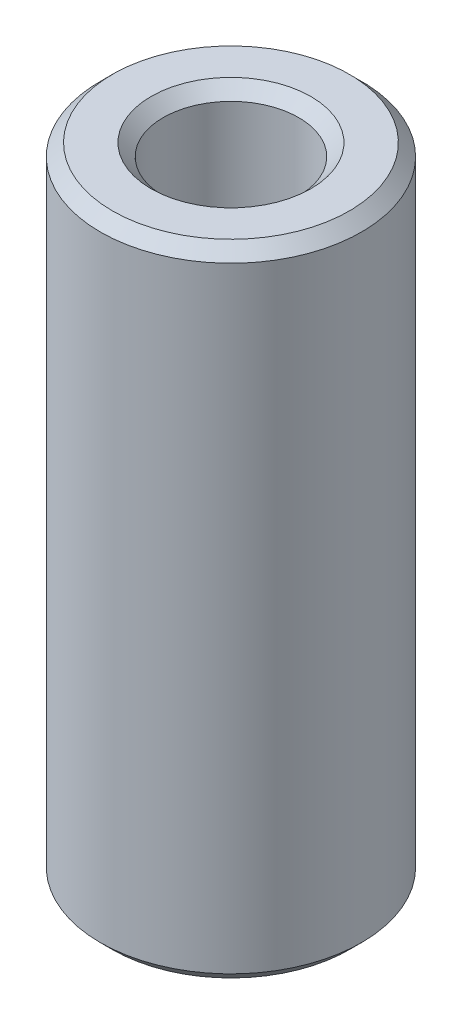
ISO-10303-21;
HEADER;
FILE_DESCRIPTION(('STEP AP214'),'2;1');
FILE_NAME('part.step','',(''),(''),'','','');
FILE_SCHEMA(('AUTOMOTIVE_DESIGN { 1 0 10303 214 1 1 1 1 }'));
ENDSEC;
DATA;
#1=APPLICATION_CONTEXT('core data for automotive mechanical design processes');
#2=APPLICATION_PROTOCOL_DEFINITION('international standard','automotive_design',2000,#1);
#3=PRODUCT_CONTEXT('',#1,'mechanical');
#4=PRODUCT('Part','Part','',(#3));
#5=PRODUCT_RELATED_PRODUCT_CATEGORY('part','',(#4));
#6=PRODUCT_DEFINITION_FORMATION('','',#4);
#7=PRODUCT_DEFINITION_CONTEXT('part definition',#1,'design');
#8=PRODUCT_DEFINITION('design','',#6,#7);
#9=PRODUCT_DEFINITION_SHAPE('','',#8);
#10=(LENGTH_UNIT() NAMED_UNIT(*) SI_UNIT(.MILLI.,.METRE.));
#11=(NAMED_UNIT(*) PLANE_ANGLE_UNIT() SI_UNIT($,.RADIAN.));
#12=(NAMED_UNIT(*) SI_UNIT($,.STERADIAN.) SOLID_ANGLE_UNIT());
#13=UNCERTAINTY_MEASURE_WITH_UNIT(LENGTH_MEASURE(1.E-05),#10,'distance_accuracy_value','');
#14=(GEOMETRIC_REPRESENTATION_CONTEXT(3) GLOBAL_UNCERTAINTY_ASSIGNED_CONTEXT((#13)) GLOBAL_UNIT_ASSIGNED_CONTEXT((#10,
#11,#12)) REPRESENTATION_CONTEXT('',''));
#15=CARTESIAN_POINT('',(0.,0.,0.));
#16=DIRECTION('',(0.,0.,1.));
#17=DIRECTION('',(1.,0.,0.));
#18=AXIS2_PLACEMENT_3D('',#15,#16,#17);
#19=CARTESIAN_POINT('',(0.,146.986770155296,0.));
#20=DIRECTION('',(0.,-1.,0.));
#21=DIRECTION('',(0.,0.,-1.));
#22=AXIS2_PLACEMENT_3D('',#19,#20,#21);
#23=CYLINDRICAL_SURFACE('',#22,30.);
#24=CARTESIAN_POINT('',(0.,2.79521145977338,0.));
#25=DIRECTION('',(0.,1.,0.));
#26=DIRECTION('',(0.,0.,1.));
#27=AXIS2_PLACEMENT_3D('',#24,#25,#26);
#28=CIRCLE('',#27,30.);
#29=CARTESIAN_POINT('',(0.,2.79521145977338,30.));
#30=VERTEX_POINT('',#29);
#31=EDGE_CURVE('E10',#30,#30,#28,.T.);
#32=ORIENTED_EDGE('',*,*,#31,.T.);
#33=EDGE_LOOP('',(#32));
#34=FACE_BOUND('',#33,.T.);
#35=CARTESIAN_POINT('',(0.,144.191558695522,0.));
#36=DIRECTION('',(0.,1.,0.));
#37=DIRECTION('',(0.,0.,1.));
#38=AXIS2_PLACEMENT_3D('',#35,#36,#37);
#39=CIRCLE('',#38,30.);
#40=CARTESIAN_POINT('',(0.,144.191558695522,30.));
#41=VERTEX_POINT('',#40);
#42=EDGE_CURVE('E50',#41,#41,#39,.F.);
#43=ORIENTED_EDGE('',*,*,#42,.T.);
#44=EDGE_LOOP('',(#43));
#45=FACE_BOUND('',#44,.T.);
#46=ADVANCED_FACE('F39',(#34,#45),#23,.T.);
#47=CARTESIAN_POINT('',(0.,146.986770155296,0.));
#48=DIRECTION('',(0.,1.,0.));
#49=DIRECTION('',(0.,0.,1.));
#50=AXIS2_PLACEMENT_3D('',#47,#48,#49);
#51=PLANE('',#50);
#52=CARTESIAN_POINT('',(0.,146.986770155296,0.));
#53=DIRECTION('',(0.,1.,0.));
#54=DIRECTION('',(0.,0.,1.));
#55=AXIS2_PLACEMENT_3D('',#52,#53,#54);
#56=CIRCLE('',#55,18.363881996797);
#57=CARTESIAN_POINT('',(0.,146.986770155296,18.363881996797));
#58=VERTEX_POINT('',#57);
#59=EDGE_CURVE('E58',#58,#58,#56,.F.);
#60=ORIENTED_EDGE('',*,*,#59,.T.);
#61=EDGE_LOOP('',(#60));
#62=FACE_BOUND('',#61,.T.);
#63=CARTESIAN_POINT('',(0.,146.986770155296,0.));
#64=DIRECTION('',(0.,1.,0.));
#65=DIRECTION('',(0.,0.,1.));
#66=AXIS2_PLACEMENT_3D('',#63,#64,#65);
#67=CIRCLE('',#66,27.2047885402266);
#68=CARTESIAN_POINT('',(0.,146.986770155296,27.2047885402266));
#69=VERTEX_POINT('',#68);
#70=EDGE_CURVE('E61',#69,#69,#67,.T.);
#71=ORIENTED_EDGE('',*,*,#70,.T.);
#72=EDGE_LOOP('',(#71));
#73=FACE_BOUND('',#72,.T.);
#74=ADVANCED_FACE('F88',(#62,#73),#51,.T.);
#75=CARTESIAN_POINT('',(0.,0.,0.));
#76=DIRECTION('',(0.,1.,0.));
#77=DIRECTION('',(0.,0.,1.));
#78=AXIS2_PLACEMENT_3D('',#75,#76,#77);
#79=PLANE('',#78);
#80=CARTESIAN_POINT('',(0.,0.,0.));
#81=DIRECTION('',(0.,1.,0.));
#82=DIRECTION('',(0.,0.,1.));
#83=AXIS2_PLACEMENT_3D('',#80,#81,#82);
#84=CIRCLE('',#83,18.363881996797);
#85=CARTESIAN_POINT('',(0.,0.,18.363881996797));
#86=VERTEX_POINT('',#85);
#87=EDGE_CURVE('E51',#86,#86,#84,.T.);
#88=ORIENTED_EDGE('',*,*,#87,.T.);
#89=EDGE_LOOP('',(#88));
#90=FACE_BOUND('',#89,.T.);
#91=CARTESIAN_POINT('',(0.,0.,0.));
#92=DIRECTION('',(0.,1.,0.));
#93=DIRECTION('',(0.,0.,1.));
#94=AXIS2_PLACEMENT_3D('',#91,#92,#93);
#95=CIRCLE('',#94,27.2047885402266);
#96=CARTESIAN_POINT('',(0.,0.,27.2047885402266));
#97=VERTEX_POINT('',#96);
#98=EDGE_CURVE('E54',#97,#97,#95,.F.);
#99=ORIENTED_EDGE('',*,*,#98,.T.);
#100=EDGE_LOOP('',(#99));
#101=FACE_BOUND('',#100,.T.);
#102=ADVANCED_FACE('F83',(#90,#101),#79,.F.);
#103=CARTESIAN_POINT('',(0.,146.986770155296,0.));
#104=DIRECTION('',(0.,-1.,0.));
#105=DIRECTION('',(0.,0.,-1.));
#106=AXIS2_PLACEMENT_3D('',#103,#104,#105);
#107=CYLINDRICAL_SURFACE('',#106,15.5686705370235);
#108=CARTESIAN_POINT('',(0.,144.191558695522,0.));
#109=DIRECTION('',(0.,1.,0.));
#110=DIRECTION('',(0.,0.,1.));
#111=AXIS2_PLACEMENT_3D('',#108,#109,#110);
#112=CIRCLE('',#111,15.5686705370235);
#113=CARTESIAN_POINT('',(0.,144.191558695522,15.5686705370235));
#114=VERTEX_POINT('',#113);
#115=EDGE_CURVE('E67',#114,#114,#112,.T.);
#116=ORIENTED_EDGE('',*,*,#115,.T.);
#117=EDGE_LOOP('',(#116));
#118=FACE_BOUND('',#117,.T.);
#119=CARTESIAN_POINT('',(0.,2.79521145977346,0.));
#120=DIRECTION('',(0.,1.,0.));
#121=DIRECTION('',(0.,0.,1.));
#122=AXIS2_PLACEMENT_3D('',#119,#120,#121);
#123=CIRCLE('',#122,15.5686705370235);
#124=CARTESIAN_POINT('',(0.,2.79521145977346,15.5686705370235));
#125=VERTEX_POINT('',#124);
#126=EDGE_CURVE('E69',#125,#125,#123,.F.);
#127=ORIENTED_EDGE('',*,*,#126,.T.);
#128=EDGE_LOOP('',(#127));
#129=FACE_BOUND('',#128,.T.);
#130=ADVANCED_FACE('F71',(#118,#129),#107,.F.);
#131=CARTESIAN_POINT('',(0.,144.191558695522,0.));
#132=DIRECTION('',(0.,1.,0.));
#133=DIRECTION('',(0.,0.,1.));
#134=AXIS2_PLACEMENT_3D('',#131,#132,#133);
#135=CONICAL_SURFACE('',#134,15.5686705370235,0.785398163397448);
#136=ORIENTED_EDGE('',*,*,#59,.F.);
#137=EDGE_LOOP('',(#136));
#138=FACE_BOUND('',#137,.T.);
#139=ORIENTED_EDGE('',*,*,#115,.F.);
#140=EDGE_LOOP('',(#139));
#141=FACE_BOUND('',#140,.T.);
#142=ADVANCED_FACE('F77',(#138,#141),#135,.F.);
#143=CARTESIAN_POINT('',(0.,0.,0.));
#144=DIRECTION('',(0.,-1.,0.));
#145=DIRECTION('',(0.,0.,-1.));
#146=AXIS2_PLACEMENT_3D('',#143,#144,#145);
#147=CONICAL_SURFACE('',#146,18.363881996797,0.785398163397446);
#148=ORIENTED_EDGE('',*,*,#126,.F.);
#149=EDGE_LOOP('',(#148));
#150=FACE_BOUND('',#149,.T.);
#151=ORIENTED_EDGE('',*,*,#87,.F.);
#152=EDGE_LOOP('',(#151));
#153=FACE_BOUND('',#152,.T.);
#154=ADVANCED_FACE('F73',(#150,#153),#147,.F.);
#155=CARTESIAN_POINT('',(0.,2.79521145977338,0.));
#156=DIRECTION('',(0.,1.,0.));
#157=DIRECTION('',(0.,0.,1.));
#158=AXIS2_PLACEMENT_3D('',#155,#156,#157);
#159=CONICAL_SURFACE('',#158,30.,0.785398163397451);
#160=ORIENTED_EDGE('',*,*,#98,.F.);
#161=EDGE_LOOP('',(#160));
#162=FACE_BOUND('',#161,.T.);
#163=ORIENTED_EDGE('',*,*,#31,.F.);
#164=EDGE_LOOP('',(#163));
#165=FACE_BOUND('',#164,.T.);
#166=ADVANCED_FACE('F76',(#162,#165),#159,.T.);
#167=CARTESIAN_POINT('',(0.,146.986770155296,0.));
#168=DIRECTION('',(0.,-1.,0.));
#169=DIRECTION('',(0.,0.,-1.));
#170=AXIS2_PLACEMENT_3D('',#167,#168,#169);
#171=CONICAL_SURFACE('',#170,27.2047885402266,0.785398163397451);
#172=ORIENTED_EDGE('',*,*,#42,.F.);
#173=EDGE_LOOP('',(#172));
#174=FACE_BOUND('',#173,.T.);
#175=ORIENTED_EDGE('',*,*,#70,.F.);
#176=EDGE_LOOP('',(#175));
#177=FACE_BOUND('',#176,.T.);
#178=ADVANCED_FACE('F45',(#174,#177),#171,.T.);
#179=CLOSED_SHELL('',(#46,#74,#102,#130,#142,#154,#166,#178));
#180=MANIFOLD_SOLID_BREP('B2',#179);
#181=ADVANCED_BREP_SHAPE_REPRESENTATION('',(#18,#180),#14);
#182=SHAPE_DEFINITION_REPRESENTATION(#9,#181);
ENDSEC;
END-ISO-10303-21;
